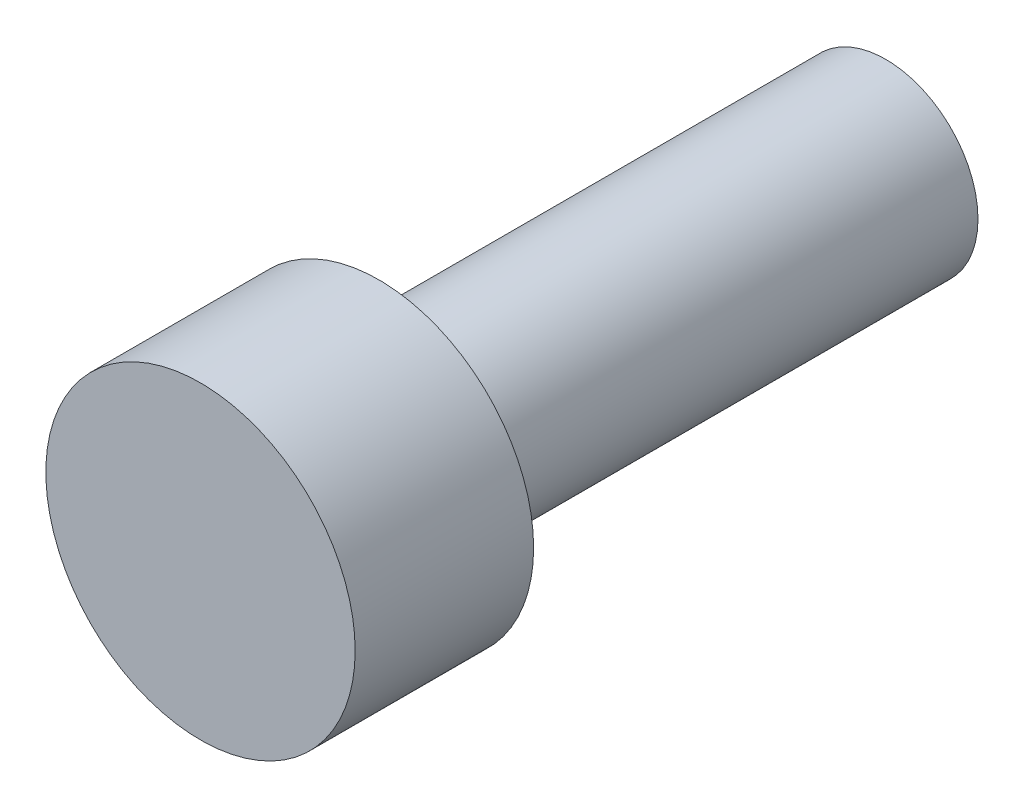
ISO-10303-21;
HEADER;
FILE_DESCRIPTION(('STEP AP214'),'2;1');
FILE_NAME('part.step','',(''),(''),'','','');
FILE_SCHEMA(('AUTOMOTIVE_DESIGN { 1 0 10303 214 1 1 1 1 }'));
ENDSEC;
DATA;
#1=APPLICATION_CONTEXT('core data for automotive mechanical design processes');
#2=APPLICATION_PROTOCOL_DEFINITION('international standard','automotive_design',2000,#1);
#3=PRODUCT_CONTEXT('',#1,'mechanical');
#4=PRODUCT('Part','Part','',(#3));
#5=PRODUCT_RELATED_PRODUCT_CATEGORY('part','',(#4));
#6=PRODUCT_DEFINITION_FORMATION('','',#4);
#7=PRODUCT_DEFINITION_CONTEXT('part definition',#1,'design');
#8=PRODUCT_DEFINITION('design','',#6,#7);
#9=PRODUCT_DEFINITION_SHAPE('','',#8);
#10=(LENGTH_UNIT() NAMED_UNIT(*) SI_UNIT(.MILLI.,.METRE.));
#11=(NAMED_UNIT(*) PLANE_ANGLE_UNIT() SI_UNIT($,.RADIAN.));
#12=(NAMED_UNIT(*) SI_UNIT($,.STERADIAN.) SOLID_ANGLE_UNIT());
#13=UNCERTAINTY_MEASURE_WITH_UNIT(LENGTH_MEASURE(1.E-05),#10,'distance_accuracy_value','');
#14=(GEOMETRIC_REPRESENTATION_CONTEXT(3) GLOBAL_UNCERTAINTY_ASSIGNED_CONTEXT((#13)) GLOBAL_UNIT_ASSIGNED_CONTEXT((#10,
#11,#12)) REPRESENTATION_CONTEXT('',''));
#15=CARTESIAN_POINT('',(0.,0.,0.));
#16=DIRECTION('',(0.,0.,1.));
#17=DIRECTION('',(1.,0.,0.));
#18=AXIS2_PLACEMENT_3D('',#15,#16,#17);
#19=CARTESIAN_POINT('',(0.,0.,7.5));
#20=DIRECTION('',(0.,0.,-1.));
#21=DIRECTION('',(-1.,0.,0.));
#22=AXIS2_PLACEMENT_3D('',#19,#20,#21);
#23=CYLINDRICAL_SURFACE('',#22,6.5);
#24=CARTESIAN_POINT('',(0.,0.,7.5));
#25=DIRECTION('',(0.,0.,1.));
#26=DIRECTION('',(1.,0.,0.));
#27=AXIS2_PLACEMENT_3D('',#24,#25,#26);
#28=CIRCLE('',#27,6.5);
#29=CARTESIAN_POINT('',(6.5,0.,7.5));
#30=VERTEX_POINT('',#29);
#31=EDGE_CURVE('E39',#30,#30,#28,.T.);
#32=ORIENTED_EDGE('',*,*,#31,.F.);
#33=EDGE_LOOP('',(#32));
#34=FACE_BOUND('',#33,.T.);
#35=CARTESIAN_POINT('',(0.,0.,0.));
#36=DIRECTION('',(0.,0.,1.));
#37=DIRECTION('',(1.,0.,0.));
#38=AXIS2_PLACEMENT_3D('',#35,#36,#37);
#39=CIRCLE('',#38,6.5);
#40=CARTESIAN_POINT('',(6.5,0.,0.));
#41=VERTEX_POINT('',#40);
#42=EDGE_CURVE('E43',#41,#41,#39,.T.);
#43=ORIENTED_EDGE('',*,*,#42,.T.);
#44=EDGE_LOOP('',(#43));
#45=FACE_BOUND('',#44,.T.);
#46=ADVANCED_FACE('F33',(#34,#45),#23,.T.);
#47=CARTESIAN_POINT('',(0.,0.,7.5));
#48=DIRECTION('',(0.,0.,1.));
#49=DIRECTION('',(1.,0.,0.));
#50=AXIS2_PLACEMENT_3D('',#47,#48,#49);
#51=PLANE('',#50);
#52=ORIENTED_EDGE('',*,*,#31,.T.);
#53=EDGE_LOOP('',(#52));
#54=FACE_BOUND('',#53,.T.);
#55=ADVANCED_FACE('F64',(#54),#51,.T.);
#56=CARTESIAN_POINT('',(0.,0.,0.));
#57=DIRECTION('',(0.,0.,1.));
#58=DIRECTION('',(1.,0.,0.));
#59=AXIS2_PLACEMENT_3D('',#56,#57,#58);
#60=PLANE('',#59);
#61=CARTESIAN_POINT('',(0.,0.,0.));
#62=DIRECTION('',(0.,0.,1.));
#63=DIRECTION('',(1.,0.,0.));
#64=AXIS2_PLACEMENT_3D('',#61,#62,#63);
#65=CIRCLE('',#64,3.875);
#66=CARTESIAN_POINT('',(3.875,0.,0.));
#67=VERTEX_POINT('',#66);
#68=EDGE_CURVE('E10',#67,#67,#65,.F.);
#69=ORIENTED_EDGE('',*,*,#68,.F.);
#70=EDGE_LOOP('',(#69));
#71=FACE_BOUND('',#70,.T.);
#72=ORIENTED_EDGE('',*,*,#42,.F.);
#73=EDGE_LOOP('',(#72));
#74=FACE_BOUND('',#73,.T.);
#75=ADVANCED_FACE('F57',(#71,#74),#60,.F.);
#76=CARTESIAN_POINT('',(0.,0.,-21.3));
#77=DIRECTION('',(0.,0.,1.));
#78=DIRECTION('',(1.,0.,0.));
#79=AXIS2_PLACEMENT_3D('',#76,#77,#78);
#80=CYLINDRICAL_SURFACE('',#79,3.875);
#81=CARTESIAN_POINT('',(0.,0.,-21.3));
#82=DIRECTION('',(0.,0.,-1.));
#83=DIRECTION('',(-1.,0.,0.));
#84=AXIS2_PLACEMENT_3D('',#81,#82,#83);
#85=CIRCLE('',#84,3.875);
#86=CARTESIAN_POINT('',(-3.875,0.,-21.3));
#87=VERTEX_POINT('',#86);
#88=EDGE_CURVE('E48',#87,#87,#85,.T.);
#89=ORIENTED_EDGE('',*,*,#88,.F.);
#90=EDGE_LOOP('',(#89));
#91=FACE_BOUND('',#90,.T.);
#92=ORIENTED_EDGE('',*,*,#68,.T.);
#93=EDGE_LOOP('',(#92));
#94=FACE_BOUND('',#93,.T.);
#95=ADVANCED_FACE('F55',(#91,#94),#80,.T.);
#96=CARTESIAN_POINT('',(0.,0.,-21.3));
#97=DIRECTION('',(0.,0.,-1.));
#98=DIRECTION('',(-1.,0.,0.));
#99=AXIS2_PLACEMENT_3D('',#96,#97,#98);
#100=PLANE('',#99);
#101=ORIENTED_EDGE('',*,*,#88,.T.);
#102=EDGE_LOOP('',(#101));
#103=FACE_BOUND('',#102,.T.);
#104=ADVANCED_FACE('F53',(#103),#100,.T.);
#105=CLOSED_SHELL('',(#46,#55,#75,#95,#104));
#106=MANIFOLD_SOLID_BREP('B2',#105);
#107=ADVANCED_BREP_SHAPE_REPRESENTATION('',(#18,#106),#14);
#108=SHAPE_DEFINITION_REPRESENTATION(#9,#107);
ENDSEC;
END-ISO-10303-21;
